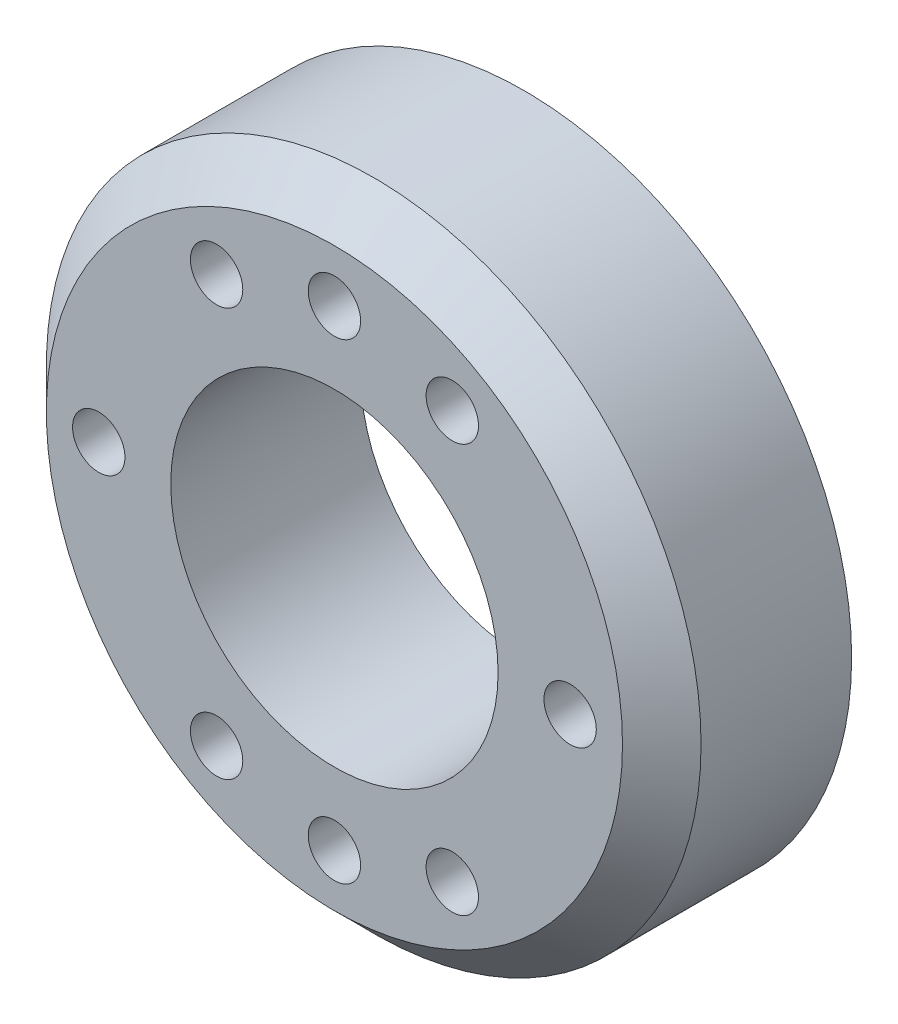
ISO-10303-21;
HEADER;
FILE_DESCRIPTION(('STEP AP214'),'2;1');
FILE_NAME('part.step','',(''),(''),'','','');
FILE_SCHEMA(('AUTOMOTIVE_DESIGN { 1 0 10303 214 1 1 1 1 }'));
ENDSEC;
DATA;
#1=APPLICATION_CONTEXT('core data for automotive mechanical design processes');
#2=APPLICATION_PROTOCOL_DEFINITION('international standard','automotive_design',2000,#1);
#3=PRODUCT_CONTEXT('',#1,'mechanical');
#4=PRODUCT('Part','Part','',(#3));
#5=PRODUCT_RELATED_PRODUCT_CATEGORY('part','',(#4));
#6=PRODUCT_DEFINITION_FORMATION('','',#4);
#7=PRODUCT_DEFINITION_CONTEXT('part definition',#1,'design');
#8=PRODUCT_DEFINITION('design','',#6,#7);
#9=PRODUCT_DEFINITION_SHAPE('','',#8);
#10=(LENGTH_UNIT() NAMED_UNIT(*) SI_UNIT(.MILLI.,.METRE.));
#11=(NAMED_UNIT(*) PLANE_ANGLE_UNIT() SI_UNIT($,.RADIAN.));
#12=(NAMED_UNIT(*) SI_UNIT($,.STERADIAN.) SOLID_ANGLE_UNIT());
#13=UNCERTAINTY_MEASURE_WITH_UNIT(LENGTH_MEASURE(1.E-05),#10,'distance_accuracy_value','');
#14=(GEOMETRIC_REPRESENTATION_CONTEXT(3) GLOBAL_UNCERTAINTY_ASSIGNED_CONTEXT((#13)) GLOBAL_UNIT_ASSIGNED_CONTEXT((#10,
#11,#12)) REPRESENTATION_CONTEXT('',''));
#15=CARTESIAN_POINT('',(0.,0.,0.));
#16=DIRECTION('',(0.,0.,1.));
#17=DIRECTION('',(1.,0.,0.));
#18=AXIS2_PLACEMENT_3D('',#15,#16,#17);
#19=CARTESIAN_POINT('',(0.,0.,14.5));
#20=DIRECTION('',(0.,0.,1.));
#21=DIRECTION('',(1.,0.,0.));
#22=AXIS2_PLACEMENT_3D('',#19,#20,#21);
#23=PLANE('',#22);
#24=CARTESIAN_POINT('',(0.,0.,14.5));
#25=DIRECTION('',(0.,0.,1.));
#26=DIRECTION('',(1.,0.,0.));
#27=AXIS2_PLACEMENT_3D('',#24,#25,#26);
#28=CIRCLE('',#27,22.);
#29=CARTESIAN_POINT('',(22.,0.,14.5));
#30=VERTEX_POINT('',#29);
#31=EDGE_CURVE('E44',#30,#30,#28,.T.);
#32=ORIENTED_EDGE('',*,*,#31,.T.);
#33=EDGE_LOOP('',(#32));
#34=FACE_BOUND('',#33,.T.);
#35=CARTESIAN_POINT('',(-18.,0.,14.5));
#36=DIRECTION('',(0.,0.,1.));
#37=DIRECTION('',(1.,0.,0.));
#38=AXIS2_PLACEMENT_3D('',#35,#36,#37);
#39=CIRCLE('',#38,2.);
#40=CARTESIAN_POINT('',(-16.,0.,14.5));
#41=VERTEX_POINT('',#40);
#42=EDGE_CURVE('E94',#41,#41,#39,.T.);
#43=ORIENTED_EDGE('',*,*,#42,.F.);
#44=EDGE_LOOP('',(#43));
#45=FACE_BOUND('',#44,.T.);
#46=CARTESIAN_POINT('',(0.,-18.,14.5));
#47=DIRECTION('',(0.,0.,1.));
#48=DIRECTION('',(1.,0.,0.));
#49=AXIS2_PLACEMENT_3D('',#46,#47,#48);
#50=CIRCLE('',#49,2.);
#51=CARTESIAN_POINT('',(2.,-18.,14.5));
#52=VERTEX_POINT('',#51);
#53=EDGE_CURVE('E82',#52,#52,#50,.T.);
#54=ORIENTED_EDGE('',*,*,#53,.F.);
#55=EDGE_LOOP('',(#54));
#56=FACE_BOUND('',#55,.T.);
#57=CARTESIAN_POINT('',(18.,0.,14.5));
#58=DIRECTION('',(0.,0.,1.));
#59=DIRECTION('',(1.,0.,0.));
#60=AXIS2_PLACEMENT_3D('',#57,#58,#59);
#61=CIRCLE('',#60,2.);
#62=CARTESIAN_POINT('',(20.,0.,14.5));
#63=VERTEX_POINT('',#62);
#64=EDGE_CURVE('E70',#63,#63,#61,.T.);
#65=ORIENTED_EDGE('',*,*,#64,.F.);
#66=EDGE_LOOP('',(#65));
#67=FACE_BOUND('',#66,.T.);
#68=CARTESIAN_POINT('',(0.,18.,14.5));
#69=DIRECTION('',(0.,0.,1.));
#70=DIRECTION('',(1.,0.,0.));
#71=AXIS2_PLACEMENT_3D('',#68,#69,#70);
#72=CIRCLE('',#71,2.);
#73=CARTESIAN_POINT('',(2.,18.,14.5));
#74=VERTEX_POINT('',#73);
#75=EDGE_CURVE('E58',#74,#74,#72,.T.);
#76=ORIENTED_EDGE('',*,*,#75,.F.);
#77=EDGE_LOOP('',(#76));
#78=FACE_BOUND('',#77,.T.);
#79=CARTESIAN_POINT('',(0.,0.,14.5));
#80=DIRECTION('',(0.,0.,1.));
#81=DIRECTION('',(1.,0.,0.));
#82=AXIS2_PLACEMENT_3D('',#79,#80,#81);
#83=CIRCLE('',#82,12.5);
#84=CARTESIAN_POINT('',(12.5,0.,14.5));
#85=VERTEX_POINT('',#84);
#86=EDGE_CURVE('E52',#85,#85,#83,.T.);
#87=ORIENTED_EDGE('',*,*,#86,.F.);
#88=EDGE_LOOP('',(#87));
#89=FACE_BOUND('',#88,.T.);
#90=CARTESIAN_POINT('',(9.,15.5884572681199,14.5));
#91=DIRECTION('',(0.,0.,1.));
#92=DIRECTION('',(1.,0.,0.));
#93=AXIS2_PLACEMENT_3D('',#90,#91,#92);
#94=CIRCLE('',#93,2.);
#95=CARTESIAN_POINT('',(11.,15.5884572681199,14.5));
#96=VERTEX_POINT('',#95);
#97=EDGE_CURVE('E64',#96,#96,#94,.T.);
#98=ORIENTED_EDGE('',*,*,#97,.F.);
#99=EDGE_LOOP('',(#98));
#100=FACE_BOUND('',#99,.T.);
#101=CARTESIAN_POINT('',(9.00000000000001,-15.5884572681199,14.5));
#102=DIRECTION('',(0.,0.,1.));
#103=DIRECTION('',(1.,0.,0.));
#104=AXIS2_PLACEMENT_3D('',#101,#102,#103);
#105=CIRCLE('',#104,2.);
#106=CARTESIAN_POINT('',(11.,-15.5884572681199,14.5));
#107=VERTEX_POINT('',#106);
#108=EDGE_CURVE('E76',#107,#107,#105,.T.);
#109=ORIENTED_EDGE('',*,*,#108,.F.);
#110=EDGE_LOOP('',(#109));
#111=FACE_BOUND('',#110,.T.);
#112=CARTESIAN_POINT('',(-8.99999999999999,-15.5884572681199,14.5));
#113=DIRECTION('',(0.,0.,1.));
#114=DIRECTION('',(1.,0.,0.));
#115=AXIS2_PLACEMENT_3D('',#112,#113,#114);
#116=CIRCLE('',#115,2.);
#117=CARTESIAN_POINT('',(-6.99999999999999,-15.5884572681199,14.5));
#118=VERTEX_POINT('',#117);
#119=EDGE_CURVE('E88',#118,#118,#116,.T.);
#120=ORIENTED_EDGE('',*,*,#119,.F.);
#121=EDGE_LOOP('',(#120));
#122=FACE_BOUND('',#121,.T.);
#123=CARTESIAN_POINT('',(-9.00000000000001,15.5884572681199,14.5));
#124=DIRECTION('',(0.,0.,1.));
#125=DIRECTION('',(1.,0.,0.));
#126=AXIS2_PLACEMENT_3D('',#123,#124,#125);
#127=CIRCLE('',#126,2.);
#128=CARTESIAN_POINT('',(-7.,15.5884572681199,14.5));
#129=VERTEX_POINT('',#128);
#130=EDGE_CURVE('E100',#129,#129,#127,.T.);
#131=ORIENTED_EDGE('',*,*,#130,.F.);
#132=EDGE_LOOP('',(#131));
#133=FACE_BOUND('',#132,.T.);
#134=ADVANCED_FACE('F36',(#34,#45,#56,#67,#78,#89,#100,#111,#122,#133),#23,.T.);
#135=CARTESIAN_POINT('',(0.,0.,0.));
#136=DIRECTION('',(0.,0.,1.));
#137=DIRECTION('',(1.,0.,0.));
#138=AXIS2_PLACEMENT_3D('',#135,#136,#137);
#139=PLANE('',#138);
#140=CARTESIAN_POINT('',(0.,0.,0.));
#141=DIRECTION('',(0.,0.,1.));
#142=DIRECTION('',(1.,0.,0.));
#143=AXIS2_PLACEMENT_3D('',#140,#141,#142);
#144=CIRCLE('',#143,25.);
#145=CARTESIAN_POINT('',(25.,0.,0.));
#146=VERTEX_POINT('',#145);
#147=EDGE_CURVE('E48',#146,#146,#144,.T.);
#148=ORIENTED_EDGE('',*,*,#147,.F.);
#149=EDGE_LOOP('',(#148));
#150=FACE_BOUND('',#149,.T.);
#151=CARTESIAN_POINT('',(0.,0.,0.));
#152=DIRECTION('',(0.,0.,1.));
#153=DIRECTION('',(1.,0.,0.));
#154=AXIS2_PLACEMENT_3D('',#151,#152,#153);
#155=CIRCLE('',#154,12.5);
#156=CARTESIAN_POINT('',(12.5,0.,0.));
#157=VERTEX_POINT('',#156);
#158=EDGE_CURVE('E55',#157,#157,#155,.T.);
#159=ORIENTED_EDGE('',*,*,#158,.T.);
#160=EDGE_LOOP('',(#159));
#161=FACE_BOUND('',#160,.T.);
#162=CARTESIAN_POINT('',(0.,18.,0.));
#163=DIRECTION('',(0.,0.,1.));
#164=DIRECTION('',(1.,0.,0.));
#165=AXIS2_PLACEMENT_3D('',#162,#163,#164);
#166=CIRCLE('',#165,2.);
#167=CARTESIAN_POINT('',(2.,18.,0.));
#168=VERTEX_POINT('',#167);
#169=EDGE_CURVE('E61',#168,#168,#166,.T.);
#170=ORIENTED_EDGE('',*,*,#169,.T.);
#171=EDGE_LOOP('',(#170));
#172=FACE_BOUND('',#171,.T.);
#173=CARTESIAN_POINT('',(9.,15.5884572681199,0.));
#174=DIRECTION('',(0.,0.,1.));
#175=DIRECTION('',(1.,0.,0.));
#176=AXIS2_PLACEMENT_3D('',#173,#174,#175);
#177=CIRCLE('',#176,2.);
#178=CARTESIAN_POINT('',(11.,15.5884572681199,0.));
#179=VERTEX_POINT('',#178);
#180=EDGE_CURVE('E67',#179,#179,#177,.T.);
#181=ORIENTED_EDGE('',*,*,#180,.T.);
#182=EDGE_LOOP('',(#181));
#183=FACE_BOUND('',#182,.T.);
#184=CARTESIAN_POINT('',(18.,0.,0.));
#185=DIRECTION('',(0.,0.,1.));
#186=DIRECTION('',(1.,0.,0.));
#187=AXIS2_PLACEMENT_3D('',#184,#185,#186);
#188=CIRCLE('',#187,2.);
#189=CARTESIAN_POINT('',(20.,0.,0.));
#190=VERTEX_POINT('',#189);
#191=EDGE_CURVE('E73',#190,#190,#188,.T.);
#192=ORIENTED_EDGE('',*,*,#191,.T.);
#193=EDGE_LOOP('',(#192));
#194=FACE_BOUND('',#193,.T.);
#195=CARTESIAN_POINT('',(9.00000000000001,-15.5884572681199,0.));
#196=DIRECTION('',(0.,0.,1.));
#197=DIRECTION('',(1.,0.,0.));
#198=AXIS2_PLACEMENT_3D('',#195,#196,#197);
#199=CIRCLE('',#198,2.);
#200=CARTESIAN_POINT('',(11.,-15.5884572681199,0.));
#201=VERTEX_POINT('',#200);
#202=EDGE_CURVE('E79',#201,#201,#199,.T.);
#203=ORIENTED_EDGE('',*,*,#202,.T.);
#204=EDGE_LOOP('',(#203));
#205=FACE_BOUND('',#204,.T.);
#206=CARTESIAN_POINT('',(0.,-18.,0.));
#207=DIRECTION('',(0.,0.,1.));
#208=DIRECTION('',(1.,0.,0.));
#209=AXIS2_PLACEMENT_3D('',#206,#207,#208);
#210=CIRCLE('',#209,2.);
#211=CARTESIAN_POINT('',(2.,-18.,0.));
#212=VERTEX_POINT('',#211);
#213=EDGE_CURVE('E85',#212,#212,#210,.T.);
#214=ORIENTED_EDGE('',*,*,#213,.T.);
#215=EDGE_LOOP('',(#214));
#216=FACE_BOUND('',#215,.T.);
#217=CARTESIAN_POINT('',(-8.99999999999999,-15.5884572681199,0.));
#218=DIRECTION('',(0.,0.,1.));
#219=DIRECTION('',(1.,0.,0.));
#220=AXIS2_PLACEMENT_3D('',#217,#218,#219);
#221=CIRCLE('',#220,2.);
#222=CARTESIAN_POINT('',(-6.99999999999999,-15.5884572681199,0.));
#223=VERTEX_POINT('',#222);
#224=EDGE_CURVE('E91',#223,#223,#221,.T.);
#225=ORIENTED_EDGE('',*,*,#224,.T.);
#226=EDGE_LOOP('',(#225));
#227=FACE_BOUND('',#226,.T.);
#228=CARTESIAN_POINT('',(-18.,0.,0.));
#229=DIRECTION('',(0.,0.,1.));
#230=DIRECTION('',(1.,0.,0.));
#231=AXIS2_PLACEMENT_3D('',#228,#229,#230);
#232=CIRCLE('',#231,2.);
#233=CARTESIAN_POINT('',(-16.,0.,0.));
#234=VERTEX_POINT('',#233);
#235=EDGE_CURVE('E97',#234,#234,#232,.T.);
#236=ORIENTED_EDGE('',*,*,#235,.T.);
#237=EDGE_LOOP('',(#236));
#238=FACE_BOUND('',#237,.T.);
#239=CARTESIAN_POINT('',(-9.00000000000001,15.5884572681199,0.));
#240=DIRECTION('',(0.,0.,1.));
#241=DIRECTION('',(1.,0.,0.));
#242=AXIS2_PLACEMENT_3D('',#239,#240,#241);
#243=CIRCLE('',#242,2.);
#244=CARTESIAN_POINT('',(-7.,15.5884572681199,0.));
#245=VERTEX_POINT('',#244);
#246=EDGE_CURVE('E103',#245,#245,#243,.T.);
#247=ORIENTED_EDGE('',*,*,#246,.T.);
#248=EDGE_LOOP('',(#247));
#249=FACE_BOUND('',#248,.T.);
#250=ADVANCED_FACE('F113',(#150,#161,#172,#183,#194,#205,#216,#227,#238,#249),#139,.F.);
#251=CARTESIAN_POINT('',(0.,0.,14.5));
#252=DIRECTION('',(0.,0.,-1.));
#253=DIRECTION('',(-1.,0.,0.));
#254=AXIS2_PLACEMENT_3D('',#251,#252,#253);
#255=CYLINDRICAL_SURFACE('',#254,25.);
#256=CARTESIAN_POINT('',(0.,0.,11.5));
#257=DIRECTION('',(0.,0.,1.));
#258=DIRECTION('',(1.,0.,0.));
#259=AXIS2_PLACEMENT_3D('',#256,#257,#258);
#260=CIRCLE('',#259,25.);
#261=CARTESIAN_POINT('',(25.,0.,11.5));
#262=VERTEX_POINT('',#261);
#263=EDGE_CURVE('E10',#262,#262,#260,.F.);
#264=ORIENTED_EDGE('',*,*,#263,.T.);
#265=EDGE_LOOP('',(#264));
#266=FACE_BOUND('',#265,.T.);
#267=ORIENTED_EDGE('',*,*,#147,.T.);
#268=EDGE_LOOP('',(#267));
#269=FACE_BOUND('',#268,.T.);
#270=ADVANCED_FACE('F118',(#266,#269),#255,.T.);
#271=CARTESIAN_POINT('',(0.,0.,14.5));
#272=DIRECTION('',(0.,0.,-1.));
#273=DIRECTION('',(-1.,0.,0.));
#274=AXIS2_PLACEMENT_3D('',#271,#272,#273);
#275=CYLINDRICAL_SURFACE('',#274,12.5);
#276=ORIENTED_EDGE('',*,*,#86,.T.);
#277=EDGE_LOOP('',(#276));
#278=FACE_BOUND('',#277,.T.);
#279=ORIENTED_EDGE('',*,*,#158,.F.);
#280=EDGE_LOOP('',(#279));
#281=FACE_BOUND('',#280,.T.);
#282=ADVANCED_FACE('F123',(#278,#281),#275,.F.);
#283=CARTESIAN_POINT('',(0.,18.,14.5));
#284=DIRECTION('',(0.,0.,-1.));
#285=DIRECTION('',(-1.,0.,0.));
#286=AXIS2_PLACEMENT_3D('',#283,#284,#285);
#287=CYLINDRICAL_SURFACE('',#286,2.);
#288=ORIENTED_EDGE('',*,*,#75,.T.);
#289=EDGE_LOOP('',(#288));
#290=FACE_BOUND('',#289,.T.);
#291=ORIENTED_EDGE('',*,*,#169,.F.);
#292=EDGE_LOOP('',(#291));
#293=FACE_BOUND('',#292,.T.);
#294=ADVANCED_FACE('F129',(#290,#293),#287,.F.);
#295=CARTESIAN_POINT('',(9.,15.5884572681199,14.5));
#296=DIRECTION('',(0.,0.,-1.));
#297=DIRECTION('',(-1.,0.,0.));
#298=AXIS2_PLACEMENT_3D('',#295,#296,#297);
#299=CYLINDRICAL_SURFACE('',#298,2.);
#300=ORIENTED_EDGE('',*,*,#97,.T.);
#301=EDGE_LOOP('',(#300));
#302=FACE_BOUND('',#301,.T.);
#303=ORIENTED_EDGE('',*,*,#180,.F.);
#304=EDGE_LOOP('',(#303));
#305=FACE_BOUND('',#304,.T.);
#306=ADVANCED_FACE('F177',(#302,#305),#299,.F.);
#307=CARTESIAN_POINT('',(18.,0.,14.5));
#308=DIRECTION('',(0.,0.,-1.));
#309=DIRECTION('',(-1.,0.,0.));
#310=AXIS2_PLACEMENT_3D('',#307,#308,#309);
#311=CYLINDRICAL_SURFACE('',#310,2.);
#312=ORIENTED_EDGE('',*,*,#64,.T.);
#313=EDGE_LOOP('',(#312));
#314=FACE_BOUND('',#313,.T.);
#315=ORIENTED_EDGE('',*,*,#191,.F.);
#316=EDGE_LOOP('',(#315));
#317=FACE_BOUND('',#316,.T.);
#318=ADVANCED_FACE('F173',(#314,#317),#311,.F.);
#319=CARTESIAN_POINT('',(9.00000000000001,-15.5884572681199,14.5));
#320=DIRECTION('',(0.,0.,-1.));
#321=DIRECTION('',(-1.,0.,0.));
#322=AXIS2_PLACEMENT_3D('',#319,#320,#321);
#323=CYLINDRICAL_SURFACE('',#322,2.);
#324=ORIENTED_EDGE('',*,*,#108,.T.);
#325=EDGE_LOOP('',(#324));
#326=FACE_BOUND('',#325,.T.);
#327=ORIENTED_EDGE('',*,*,#202,.F.);
#328=EDGE_LOOP('',(#327));
#329=FACE_BOUND('',#328,.T.);
#330=ADVANCED_FACE('F169',(#326,#329),#323,.F.);
#331=CARTESIAN_POINT('',(0.,-18.,14.5));
#332=DIRECTION('',(0.,0.,-1.));
#333=DIRECTION('',(-1.,0.,0.));
#334=AXIS2_PLACEMENT_3D('',#331,#332,#333);
#335=CYLINDRICAL_SURFACE('',#334,2.);
#336=ORIENTED_EDGE('',*,*,#53,.T.);
#337=EDGE_LOOP('',(#336));
#338=FACE_BOUND('',#337,.T.);
#339=ORIENTED_EDGE('',*,*,#213,.F.);
#340=EDGE_LOOP('',(#339));
#341=FACE_BOUND('',#340,.T.);
#342=ADVANCED_FACE('F165',(#338,#341),#335,.F.);
#343=CARTESIAN_POINT('',(-8.99999999999999,-15.5884572681199,14.5));
#344=DIRECTION('',(0.,0.,-1.));
#345=DIRECTION('',(-1.,0.,0.));
#346=AXIS2_PLACEMENT_3D('',#343,#344,#345);
#347=CYLINDRICAL_SURFACE('',#346,2.);
#348=ORIENTED_EDGE('',*,*,#119,.T.);
#349=EDGE_LOOP('',(#348));
#350=FACE_BOUND('',#349,.T.);
#351=ORIENTED_EDGE('',*,*,#224,.F.);
#352=EDGE_LOOP('',(#351));
#353=FACE_BOUND('',#352,.T.);
#354=ADVANCED_FACE('F159',(#350,#353),#347,.F.);
#355=CARTESIAN_POINT('',(-18.,0.,14.5));
#356=DIRECTION('',(0.,0.,-1.));
#357=DIRECTION('',(-1.,0.,0.));
#358=AXIS2_PLACEMENT_3D('',#355,#356,#357);
#359=CYLINDRICAL_SURFACE('',#358,2.);
#360=ORIENTED_EDGE('',*,*,#42,.T.);
#361=EDGE_LOOP('',(#360));
#362=FACE_BOUND('',#361,.T.);
#363=ORIENTED_EDGE('',*,*,#235,.F.);
#364=EDGE_LOOP('',(#363));
#365=FACE_BOUND('',#364,.T.);
#366=ADVANCED_FACE('F152',(#362,#365),#359,.F.);
#367=CARTESIAN_POINT('',(-9.00000000000001,15.5884572681199,14.5));
#368=DIRECTION('',(0.,0.,-1.));
#369=DIRECTION('',(-1.,0.,0.));
#370=AXIS2_PLACEMENT_3D('',#367,#368,#369);
#371=CYLINDRICAL_SURFACE('',#370,2.);
#372=ORIENTED_EDGE('',*,*,#130,.T.);
#373=EDGE_LOOP('',(#372));
#374=FACE_BOUND('',#373,.T.);
#375=ORIENTED_EDGE('',*,*,#246,.F.);
#376=EDGE_LOOP('',(#375));
#377=FACE_BOUND('',#376,.T.);
#378=ADVANCED_FACE('F109',(#374,#377),#371,.F.);
#379=CARTESIAN_POINT('',(0.,0.,14.5));
#380=DIRECTION('',(0.,0.,-1.));
#381=DIRECTION('',(-1.,0.,0.));
#382=AXIS2_PLACEMENT_3D('',#379,#380,#381);
#383=CONICAL_SURFACE('',#382,22.,0.785398163397448);
#384=ORIENTED_EDGE('',*,*,#263,.F.);
#385=EDGE_LOOP('',(#384));
#386=FACE_BOUND('',#385,.T.);
#387=ORIENTED_EDGE('',*,*,#31,.F.);
#388=EDGE_LOOP('',(#387));
#389=FACE_BOUND('',#388,.T.);
#390=ADVANCED_FACE('F39',(#386,#389),#383,.T.);
#391=CLOSED_SHELL('',(#134,#250,#270,#282,#294,#306,#318,#330,#342,#354,#366,#378,#390));
#392=MANIFOLD_SOLID_BREP('B2',#391);
#393=ADVANCED_BREP_SHAPE_REPRESENTATION('',(#18,#392),#14);
#394=SHAPE_DEFINITION_REPRESENTATION(#9,#393);
ENDSEC;
END-ISO-10303-21;
